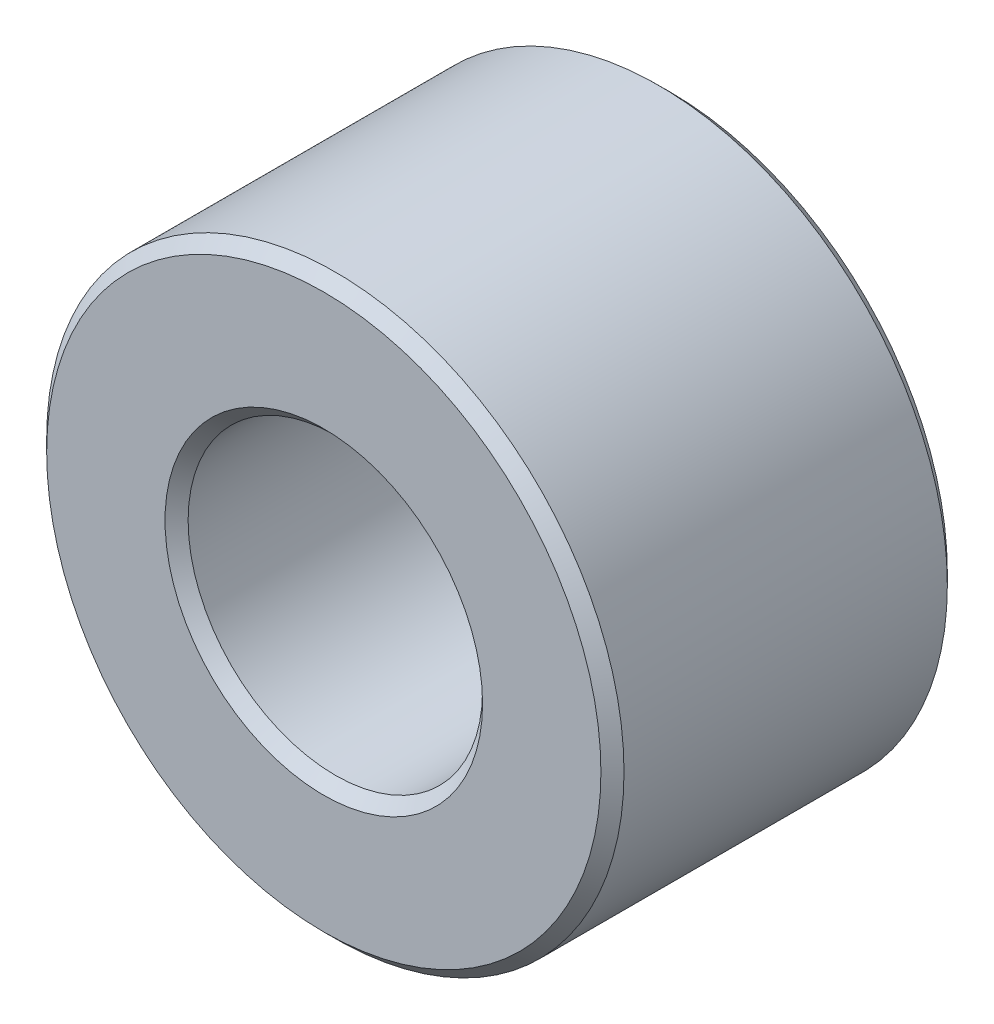
ISO-10303-21;
HEADER;
FILE_DESCRIPTION(('STEP AP214'),'2;1');
FILE_NAME('part.step','',(''),(''),'','','');
FILE_SCHEMA(('AUTOMOTIVE_DESIGN { 1 0 10303 214 1 1 1 1 }'));
ENDSEC;
DATA;
#1=APPLICATION_CONTEXT('core data for automotive mechanical design processes');
#2=APPLICATION_PROTOCOL_DEFINITION('international standard','automotive_design',2000,#1);
#3=PRODUCT_CONTEXT('',#1,'mechanical');
#4=PRODUCT('Part','Part','',(#3));
#5=PRODUCT_RELATED_PRODUCT_CATEGORY('part','',(#4));
#6=PRODUCT_DEFINITION_FORMATION('','',#4);
#7=PRODUCT_DEFINITION_CONTEXT('part definition',#1,'design');
#8=PRODUCT_DEFINITION('design','',#6,#7);
#9=PRODUCT_DEFINITION_SHAPE('','',#8);
#10=(LENGTH_UNIT() NAMED_UNIT(*) SI_UNIT(.MILLI.,.METRE.));
#11=(NAMED_UNIT(*) PLANE_ANGLE_UNIT() SI_UNIT($,.RADIAN.));
#12=(NAMED_UNIT(*) SI_UNIT($,.STERADIAN.) SOLID_ANGLE_UNIT());
#13=UNCERTAINTY_MEASURE_WITH_UNIT(LENGTH_MEASURE(1.E-05),#10,'distance_accuracy_value','');
#14=(GEOMETRIC_REPRESENTATION_CONTEXT(3) GLOBAL_UNCERTAINTY_ASSIGNED_CONTEXT((#13)) GLOBAL_UNIT_ASSIGNED_CONTEXT((#10,
#11,#12)) REPRESENTATION_CONTEXT('',''));
#15=CARTESIAN_POINT('',(0.,0.,0.));
#16=DIRECTION('',(0.,0.,1.));
#17=DIRECTION('',(1.,0.,0.));
#18=AXIS2_PLACEMENT_3D('',#15,#16,#17);
#19=CARTESIAN_POINT('',(0.,0.,6.));
#20=DIRECTION('',(0.,0.,1.));
#21=DIRECTION('',(1.,0.,0.));
#22=AXIS2_PLACEMENT_3D('',#19,#20,#21);
#23=PLANE('',#22);
#24=CARTESIAN_POINT('',(0.,0.,6.));
#25=DIRECTION('',(0.,0.,1.));
#26=DIRECTION('',(1.,0.,0.));
#27=AXIS2_PLACEMENT_3D('',#24,#25,#26);
#28=CIRCLE('',#27,2.75);
#29=CARTESIAN_POINT('',(2.75,0.,6.));
#30=VERTEX_POINT('',#29);
#31=EDGE_CURVE('E10',#30,#30,#28,.F.);
#32=ORIENTED_EDGE('',*,*,#31,.T.);
#33=EDGE_LOOP('',(#32));
#34=FACE_BOUND('',#33,.T.);
#35=CARTESIAN_POINT('',(0.,0.,6.));
#36=DIRECTION('',(0.,0.,1.));
#37=DIRECTION('',(1.,0.,0.));
#38=AXIS2_PLACEMENT_3D('',#35,#36,#37);
#39=CIRCLE('',#38,4.8);
#40=CARTESIAN_POINT('',(4.8,0.,6.));
#41=VERTEX_POINT('',#40);
#42=EDGE_CURVE('E40',#41,#41,#39,.T.);
#43=ORIENTED_EDGE('',*,*,#42,.T.);
#44=EDGE_LOOP('',(#43));
#45=FACE_BOUND('',#44,.T.);
#46=ADVANCED_FACE('F33',(#34,#45),#23,.T.);
#47=CARTESIAN_POINT('',(0.,0.,0.));
#48=DIRECTION('',(0.,0.,1.));
#49=DIRECTION('',(1.,0.,0.));
#50=AXIS2_PLACEMENT_3D('',#47,#48,#49);
#51=PLANE('',#50);
#52=CARTESIAN_POINT('',(0.,0.,0.));
#53=DIRECTION('',(0.,0.,1.));
#54=DIRECTION('',(1.,0.,0.));
#55=AXIS2_PLACEMENT_3D('',#52,#53,#54);
#56=CIRCLE('',#55,4.8);
#57=CARTESIAN_POINT('',(4.8,0.,0.));
#58=VERTEX_POINT('',#57);
#59=EDGE_CURVE('E57',#58,#58,#56,.F.);
#60=ORIENTED_EDGE('',*,*,#59,.T.);
#61=EDGE_LOOP('',(#60));
#62=FACE_BOUND('',#61,.T.);
#63=CARTESIAN_POINT('',(0.,0.,0.));
#64=DIRECTION('',(0.,0.,1.));
#65=DIRECTION('',(1.,0.,0.));
#66=AXIS2_PLACEMENT_3D('',#63,#64,#65);
#67=CIRCLE('',#66,2.75);
#68=CARTESIAN_POINT('',(2.75,0.,0.));
#69=VERTEX_POINT('',#68);
#70=EDGE_CURVE('E60',#69,#69,#67,.T.);
#71=ORIENTED_EDGE('',*,*,#70,.T.);
#72=EDGE_LOOP('',(#71));
#73=FACE_BOUND('',#72,.T.);
#74=ADVANCED_FACE('F83',(#62,#73),#51,.F.);
#75=CARTESIAN_POINT('',(0.,0.,6.));
#76=DIRECTION('',(0.,0.,-1.));
#77=DIRECTION('',(-1.,0.,0.));
#78=AXIS2_PLACEMENT_3D('',#75,#76,#77);
#79=CYLINDRICAL_SURFACE('',#78,5.);
#80=CARTESIAN_POINT('',(0.,0.,0.199999999999998));
#81=DIRECTION('',(0.,0.,1.));
#82=DIRECTION('',(1.,0.,0.));
#83=AXIS2_PLACEMENT_3D('',#80,#81,#82);
#84=CIRCLE('',#83,5.);
#85=CARTESIAN_POINT('',(5.,0.,0.199999999999998));
#86=VERTEX_POINT('',#85);
#87=EDGE_CURVE('E64',#86,#86,#84,.T.);
#88=ORIENTED_EDGE('',*,*,#87,.T.);
#89=EDGE_LOOP('',(#88));
#90=FACE_BOUND('',#89,.T.);
#91=CARTESIAN_POINT('',(0.,0.,5.8));
#92=DIRECTION('',(0.,0.,1.));
#93=DIRECTION('',(1.,0.,0.));
#94=AXIS2_PLACEMENT_3D('',#91,#92,#93);
#95=CIRCLE('',#94,5.);
#96=CARTESIAN_POINT('',(5.,0.,5.8));
#97=VERTEX_POINT('',#96);
#98=EDGE_CURVE('E67',#97,#97,#95,.F.);
#99=ORIENTED_EDGE('',*,*,#98,.T.);
#100=EDGE_LOOP('',(#99));
#101=FACE_BOUND('',#100,.T.);
#102=ADVANCED_FACE('F72',(#90,#101),#79,.T.);
#103=CARTESIAN_POINT('',(0.,0.,6.));
#104=DIRECTION('',(0.,0.,-1.));
#105=DIRECTION('',(-1.,0.,0.));
#106=AXIS2_PLACEMENT_3D('',#103,#104,#105);
#107=CYLINDRICAL_SURFACE('',#106,2.55);
#108=CARTESIAN_POINT('',(0.,0.,0.200000000000003));
#109=DIRECTION('',(0.,0.,1.));
#110=DIRECTION('',(1.,0.,0.));
#111=AXIS2_PLACEMENT_3D('',#108,#109,#110);
#112=CIRCLE('',#111,2.55);
#113=CARTESIAN_POINT('',(2.55,0.,0.200000000000003));
#114=VERTEX_POINT('',#113);
#115=EDGE_CURVE('E45',#114,#114,#112,.F.);
#116=ORIENTED_EDGE('',*,*,#115,.T.);
#117=EDGE_LOOP('',(#116));
#118=FACE_BOUND('',#117,.T.);
#119=CARTESIAN_POINT('',(0.,0.,5.8));
#120=DIRECTION('',(0.,0.,1.));
#121=DIRECTION('',(1.,0.,0.));
#122=AXIS2_PLACEMENT_3D('',#119,#120,#121);
#123=CIRCLE('',#122,2.55);
#124=CARTESIAN_POINT('',(2.55,0.,5.8));
#125=VERTEX_POINT('',#124);
#126=EDGE_CURVE('E52',#125,#125,#123,.T.);
#127=ORIENTED_EDGE('',*,*,#126,.T.);
#128=EDGE_LOOP('',(#127));
#129=FACE_BOUND('',#128,.T.);
#130=ADVANCED_FACE('F91',(#118,#129),#107,.F.);
#131=CARTESIAN_POINT('',(0.,0.,0.199999999999998));
#132=DIRECTION('',(0.,0.,1.));
#133=DIRECTION('',(1.,0.,0.));
#134=AXIS2_PLACEMENT_3D('',#131,#132,#133);
#135=CONICAL_SURFACE('',#134,5.,0.785398163397455);
#136=ORIENTED_EDGE('',*,*,#59,.F.);
#137=EDGE_LOOP('',(#136));
#138=FACE_BOUND('',#137,.T.);
#139=ORIENTED_EDGE('',*,*,#87,.F.);
#140=EDGE_LOOP('',(#139));
#141=FACE_BOUND('',#140,.T.);
#142=ADVANCED_FACE('F96',(#138,#141),#135,.T.);
#143=CARTESIAN_POINT('',(0.,0.,0.));
#144=DIRECTION('',(0.,0.,-1.));
#145=DIRECTION('',(-1.,0.,0.));
#146=AXIS2_PLACEMENT_3D('',#143,#144,#145);
#147=CONICAL_SURFACE('',#146,2.75,0.785398163397443);
#148=ORIENTED_EDGE('',*,*,#115,.F.);
#149=EDGE_LOOP('',(#148));
#150=FACE_BOUND('',#149,.T.);
#151=ORIENTED_EDGE('',*,*,#70,.F.);
#152=EDGE_LOOP('',(#151));
#153=FACE_BOUND('',#152,.T.);
#154=ADVANCED_FACE('F80',(#150,#153),#147,.F.);
#155=CARTESIAN_POINT('',(0.,0.,5.8));
#156=DIRECTION('',(0.,0.,1.));
#157=DIRECTION('',(1.,0.,0.));
#158=AXIS2_PLACEMENT_3D('',#155,#156,#157);
#159=CONICAL_SURFACE('',#158,2.55,0.785398163397454);
#160=ORIENTED_EDGE('',*,*,#31,.F.);
#161=EDGE_LOOP('',(#160));
#162=FACE_BOUND('',#161,.T.);
#163=ORIENTED_EDGE('',*,*,#126,.F.);
#164=EDGE_LOOP('',(#163));
#165=FACE_BOUND('',#164,.T.);
#166=ADVANCED_FACE('F76',(#162,#165),#159,.F.);
#167=CARTESIAN_POINT('',(0.,0.,6.));
#168=DIRECTION('',(0.,0.,-1.));
#169=DIRECTION('',(-1.,0.,0.));
#170=AXIS2_PLACEMENT_3D('',#167,#168,#169);
#171=CONICAL_SURFACE('',#170,4.8,0.785398163397448);
#172=ORIENTED_EDGE('',*,*,#98,.F.);
#173=EDGE_LOOP('',(#172));
#174=FACE_BOUND('',#173,.T.);
#175=ORIENTED_EDGE('',*,*,#42,.F.);
#176=EDGE_LOOP('',(#175));
#177=FACE_BOUND('',#176,.T.);
#178=ADVANCED_FACE('F35',(#174,#177),#171,.T.);
#179=CLOSED_SHELL('',(#46,#74,#102,#130,#142,#154,#166,#178));
#180=MANIFOLD_SOLID_BREP('B2',#179);
#181=ADVANCED_BREP_SHAPE_REPRESENTATION('',(#18,#180),#14);
#182=SHAPE_DEFINITION_REPRESENTATION(#9,#181);
ENDSEC;
END-ISO-10303-21;
